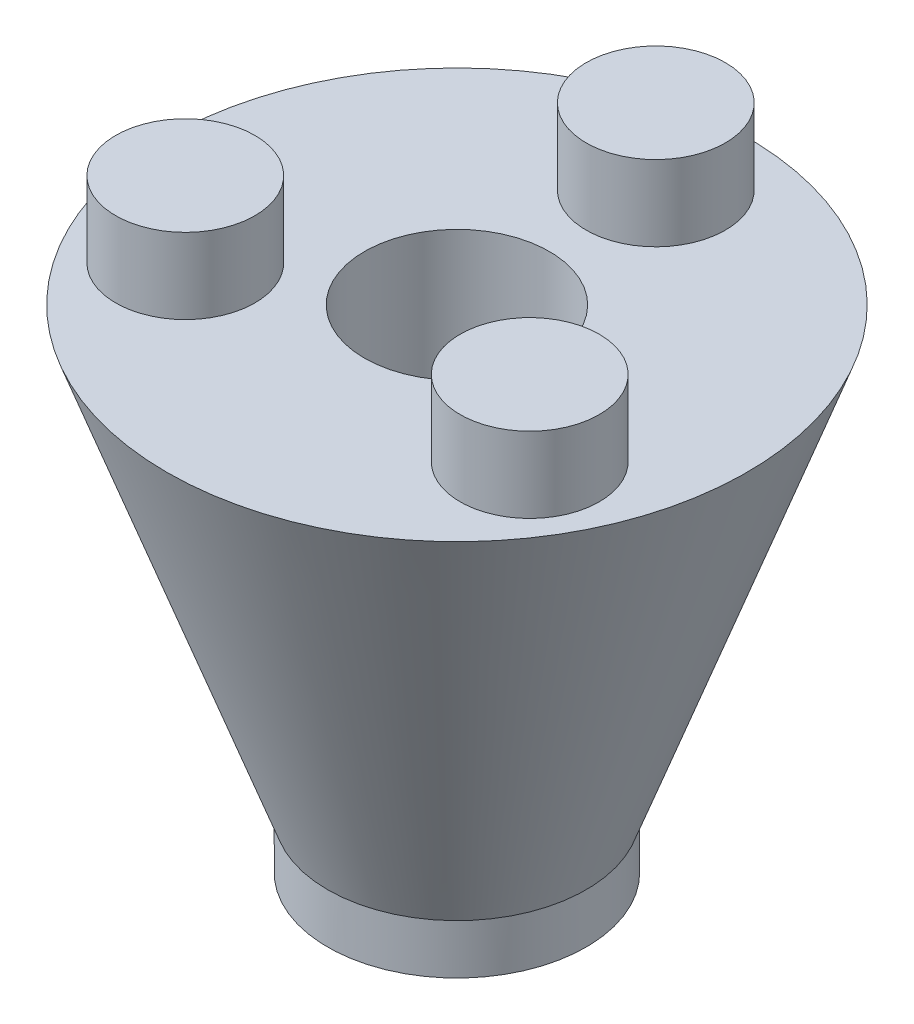
ISO-10303-21;
HEADER;
FILE_DESCRIPTION(('STEP AP214'),'2;1');
FILE_NAME('part.step','',(''),(''),'','','');
FILE_SCHEMA(('AUTOMOTIVE_DESIGN { 1 0 10303 214 1 1 1 1 }'));
ENDSEC;
DATA;
#1=APPLICATION_CONTEXT('core data for automotive mechanical design processes');
#2=APPLICATION_PROTOCOL_DEFINITION('international standard','automotive_design',2000,#1);
#3=PRODUCT_CONTEXT('',#1,'mechanical');
#4=PRODUCT('Part','Part','',(#3));
#5=PRODUCT_RELATED_PRODUCT_CATEGORY('part','',(#4));
#6=PRODUCT_DEFINITION_FORMATION('','',#4);
#7=PRODUCT_DEFINITION_CONTEXT('part definition',#1,'design');
#8=PRODUCT_DEFINITION('design','',#6,#7);
#9=PRODUCT_DEFINITION_SHAPE('','',#8);
#10=(LENGTH_UNIT() NAMED_UNIT(*) SI_UNIT(.MILLI.,.METRE.));
#11=(NAMED_UNIT(*) PLANE_ANGLE_UNIT() SI_UNIT($,.RADIAN.));
#12=(NAMED_UNIT(*) SI_UNIT($,.STERADIAN.) SOLID_ANGLE_UNIT());
#13=UNCERTAINTY_MEASURE_WITH_UNIT(LENGTH_MEASURE(1.E-05),#10,'distance_accuracy_value','');
#14=(GEOMETRIC_REPRESENTATION_CONTEXT(3) GLOBAL_UNCERTAINTY_ASSIGNED_CONTEXT((#13)) GLOBAL_UNIT_ASSIGNED_CONTEXT((#10,
#11,#12)) REPRESENTATION_CONTEXT('',''));
#15=CARTESIAN_POINT('',(0.,0.,0.));
#16=DIRECTION('',(0.,0.,1.));
#17=DIRECTION('',(1.,0.,0.));
#18=AXIS2_PLACEMENT_3D('',#15,#16,#17);
#19=CARTESIAN_POINT('',(0.,22.225,0.));
#20=DIRECTION('',(0.,1.,0.));
#21=DIRECTION('',(0.,0.,1.));
#22=AXIS2_PLACEMENT_3D('',#19,#20,#21);
#23=PLANE('',#22);
#24=CARTESIAN_POINT('',(-8.66025409500206,22.225,5.000000033));
#25=DIRECTION('',(0.,1.,0.));
#26=DIRECTION('',(0.,0.,1.));
#27=AXIS2_PLACEMENT_3D('',#24,#25,#26);
#28=CIRCLE('',#27,3.499999985);
#29=CARTESIAN_POINT('',(-8.66025409500206,22.225,1.500000048));
#30=VERTEX_POINT('',#29);
#31=EDGE_CURVE('E56',#30,#30,#28,.T.);
#32=ORIENTED_EDGE('',*,*,#31,.F.);
#33=EDGE_LOOP('',(#32));
#34=FACE_BOUND('',#33,.T.);
#35=CARTESIAN_POINT('',(0.,22.225,0.));
#36=DIRECTION('',(0.,1.,0.));
#37=DIRECTION('',(0.,0.,1.));
#38=AXIS2_PLACEMENT_3D('',#35,#36,#37);
#39=CIRCLE('',#38,14.5892385375664);
#40=CARTESIAN_POINT('',(0.,22.225,14.5892385375664));
#41=VERTEX_POINT('',#40);
#42=EDGE_CURVE('E10',#41,#41,#39,.T.);
#43=ORIENTED_EDGE('',*,*,#42,.T.);
#44=EDGE_LOOP('',(#43));
#45=FACE_BOUND('',#44,.T.);
#46=CARTESIAN_POINT('',(0.,22.225,0.));
#47=DIRECTION('',(0.,1.,0.));
#48=DIRECTION('',(0.,0.,1.));
#49=AXIS2_PLACEMENT_3D('',#46,#47,#48);
#50=CIRCLE('',#49,4.649999971);
#51=CARTESIAN_POINT('',(0.,22.225,4.649999971));
#52=VERTEX_POINT('',#51);
#53=EDGE_CURVE('E43',#52,#52,#50,.T.);
#54=ORIENTED_EDGE('',*,*,#53,.F.);
#55=EDGE_LOOP('',(#54));
#56=FACE_BOUND('',#55,.T.);
#57=CARTESIAN_POINT('',(0.,22.225,-10.000000066));
#58=DIRECTION('',(0.,1.,0.));
#59=DIRECTION('',(0.,0.,1.));
#60=AXIS2_PLACEMENT_3D('',#57,#58,#59);
#61=CIRCLE('',#60,3.499999985);
#62=CARTESIAN_POINT('',(0.,22.225,-13.500000051));
#63=VERTEX_POINT('',#62);
#64=EDGE_CURVE('E50',#63,#63,#61,.T.);
#65=ORIENTED_EDGE('',*,*,#64,.F.);
#66=EDGE_LOOP('',(#65));
#67=FACE_BOUND('',#66,.T.);
#68=CARTESIAN_POINT('',(8.66025409500207,22.225,5.000000033));
#69=DIRECTION('',(0.,1.,0.));
#70=DIRECTION('',(0.,0.,1.));
#71=AXIS2_PLACEMENT_3D('',#68,#69,#70);
#72=CIRCLE('',#71,3.499999985);
#73=CARTESIAN_POINT('',(8.66025409500207,22.225,1.500000048));
#74=VERTEX_POINT('',#73);
#75=EDGE_CURVE('E62',#74,#74,#72,.T.);
#76=ORIENTED_EDGE('',*,*,#75,.F.);
#77=EDGE_LOOP('',(#76));
#78=FACE_BOUND('',#77,.T.);
#79=ADVANCED_FACE('F32',(#34,#45,#56,#67,#78),#23,.T.);
#80=CARTESIAN_POINT('',(0.,0.,0.));
#81=DIRECTION('',(0.,1.,0.));
#82=DIRECTION('',(0.,0.,1.));
#83=AXIS2_PLACEMENT_3D('',#80,#81,#82);
#84=CONICAL_SURFACE('',#83,6.500000081,0.349065850398867);
#85=ORIENTED_EDGE('',*,*,#42,.F.);
#86=EDGE_LOOP('',(#85));
#87=FACE_BOUND('',#86,.T.);
#88=CARTESIAN_POINT('',(0.,0.,0.));
#89=DIRECTION('',(0.,-1.,0.));
#90=DIRECTION('',(0.,0.,-1.));
#91=AXIS2_PLACEMENT_3D('',#88,#89,#90);
#92=CIRCLE('',#91,6.500000081);
#93=CARTESIAN_POINT('',(0.,0.,-6.500000081));
#94=VERTEX_POINT('',#93);
#95=EDGE_CURVE('E68',#94,#94,#92,.T.);
#96=ORIENTED_EDGE('',*,*,#95,.F.);
#97=EDGE_LOOP('',(#96));
#98=FACE_BOUND('',#97,.T.);
#99=ADVANCED_FACE('F34',(#87,#98),#84,.T.);
#100=CARTESIAN_POINT('',(0.,0.,0.));
#101=DIRECTION('',(0.,1.,0.));
#102=DIRECTION('',(0.,0.,1.));
#103=AXIS2_PLACEMENT_3D('',#100,#101,#102);
#104=CYLINDRICAL_SURFACE('',#103,4.649999971);
#105=CARTESIAN_POINT('',(0.,0.,0.));
#106=DIRECTION('',(0.,1.,0.));
#107=DIRECTION('',(0.,0.,1.));
#108=AXIS2_PLACEMENT_3D('',#105,#106,#107);
#109=CIRCLE('',#108,4.649999971);
#110=CARTESIAN_POINT('',(0.,0.,4.649999971));
#111=VERTEX_POINT('',#110);
#112=EDGE_CURVE('E39',#111,#111,#109,.T.);
#113=ORIENTED_EDGE('',*,*,#112,.F.);
#114=EDGE_LOOP('',(#113));
#115=FACE_BOUND('',#114,.T.);
#116=ORIENTED_EDGE('',*,*,#53,.T.);
#117=EDGE_LOOP('',(#116));
#118=FACE_BOUND('',#117,.T.);
#119=ADVANCED_FACE('F104',(#115,#118),#104,.F.);
#120=CARTESIAN_POINT('',(0.,26.02500002,-10.000000066));
#121=DIRECTION('',(0.,-1.,0.));
#122=DIRECTION('',(0.,0.,-1.));
#123=AXIS2_PLACEMENT_3D('',#120,#121,#122);
#124=CYLINDRICAL_SURFACE('',#123,3.499999985);
#125=CARTESIAN_POINT('',(0.,26.02500002,-10.000000066));
#126=DIRECTION('',(0.,1.,0.));
#127=DIRECTION('',(0.,0.,1.));
#128=AXIS2_PLACEMENT_3D('',#125,#126,#127);
#129=CIRCLE('',#128,3.499999985);
#130=CARTESIAN_POINT('',(0.,26.02500002,-13.500000051));
#131=VERTEX_POINT('',#130);
#132=EDGE_CURVE('E48',#131,#131,#129,.T.);
#133=CARTESIAN_POINT('',(0.,26.02500002,-13.500000051));
#134=CARTESIAN_POINT('',(0.,25.9854166864583,-13.500000051));
#135=CARTESIAN_POINT('',(0.,25.9458333529167,-13.500000051));
#136=CARTESIAN_POINT('',(0.,25.8666666858333,-13.500000051));
#137=CARTESIAN_POINT('',(0.,25.8270833522917,-13.500000051));
#138=CARTESIAN_POINT('',(0.,25.7479166852083,-13.500000051));
#139=CARTESIAN_POINT('',(0.,25.7083333516667,-13.500000051));
#140=CARTESIAN_POINT('',(0.,25.6291666845833,-13.500000051));
#141=CARTESIAN_POINT('',(0.,25.5895833510417,-13.500000051));
#142=CARTESIAN_POINT('',(0.,25.5104166839583,-13.500000051));
#143=CARTESIAN_POINT('',(0.,25.4708333504167,-13.500000051));
#144=CARTESIAN_POINT('',(0.,25.3916666833333,-13.500000051));
#145=CARTESIAN_POINT('',(0.,25.3520833497917,-13.500000051));
#146=CARTESIAN_POINT('',(0.,25.2729166827083,-13.500000051));
#147=CARTESIAN_POINT('',(0.,25.2333333491667,-13.500000051));
#148=CARTESIAN_POINT('',(0.,25.1541666820833,-13.500000051));
#149=CARTESIAN_POINT('',(0.,25.1145833485417,-13.500000051));
#150=CARTESIAN_POINT('',(0.,25.0354166814583,-13.500000051));
#151=CARTESIAN_POINT('',(0.,24.9958333479167,-13.500000051));
#152=CARTESIAN_POINT('',(0.,24.9166666808333,-13.500000051));
#153=CARTESIAN_POINT('',(0.,24.8770833472917,-13.500000051));
#154=CARTESIAN_POINT('',(0.,24.7979166802083,-13.500000051));
#155=CARTESIAN_POINT('',(0.,24.7583333466667,-13.500000051));
#156=CARTESIAN_POINT('',(0.,24.6791666795833,-13.500000051));
#157=CARTESIAN_POINT('',(0.,24.6395833460417,-13.500000051));
#158=CARTESIAN_POINT('',(0.,24.5604166789583,-13.500000051));
#159=CARTESIAN_POINT('',(0.,24.5208333454167,-13.500000051));
#160=CARTESIAN_POINT('',(0.,24.4416666783333,-13.500000051));
#161=CARTESIAN_POINT('',(0.,24.4020833447917,-13.500000051));
#162=CARTESIAN_POINT('',(0.,24.3229166777083,-13.500000051));
#163=CARTESIAN_POINT('',(0.,24.2833333441667,-13.500000051));
#164=CARTESIAN_POINT('',(0.,24.2041666770833,-13.500000051));
#165=CARTESIAN_POINT('',(0.,24.1645833435417,-13.500000051));
#166=CARTESIAN_POINT('',(0.,24.0854166764583,-13.500000051));
#167=CARTESIAN_POINT('',(0.,24.0458333429167,-13.500000051));
#168=CARTESIAN_POINT('',(0.,23.9666666758333,-13.500000051));
#169=CARTESIAN_POINT('',(0.,23.9270833422917,-13.500000051));
#170=CARTESIAN_POINT('',(0.,23.8479166752083,-13.500000051));
#171=CARTESIAN_POINT('',(0.,23.8083333416667,-13.500000051));
#172=CARTESIAN_POINT('',(0.,23.7291666745833,-13.500000051));
#173=CARTESIAN_POINT('',(0.,23.6895833410417,-13.500000051));
#174=CARTESIAN_POINT('',(0.,23.6104166739583,-13.500000051));
#175=CARTESIAN_POINT('',(0.,23.5708333404167,-13.500000051));
#176=CARTESIAN_POINT('',(0.,23.4916666733333,-13.500000051));
#177=CARTESIAN_POINT('',(0.,23.4520833397917,-13.500000051));
#178=CARTESIAN_POINT('',(0.,23.3729166727083,-13.500000051));
#179=CARTESIAN_POINT('',(0.,23.3333333391667,-13.500000051));
#180=CARTESIAN_POINT('',(0.,23.2541666720833,-13.500000051));
#181=CARTESIAN_POINT('',(0.,23.2145833385417,-13.500000051));
#182=CARTESIAN_POINT('',(0.,23.1354166714583,-13.500000051));
#183=CARTESIAN_POINT('',(0.,23.0958333379167,-13.500000051));
#184=CARTESIAN_POINT('',(0.,23.0166666708333,-13.500000051));
#185=CARTESIAN_POINT('',(0.,22.9770833372917,-13.500000051));
#186=CARTESIAN_POINT('',(0.,22.8979166702083,-13.500000051));
#187=CARTESIAN_POINT('',(0.,22.8583333366667,-13.500000051));
#188=CARTESIAN_POINT('',(0.,22.7791666695833,-13.500000051));
#189=CARTESIAN_POINT('',(0.,22.7395833360417,-13.500000051));
#190=CARTESIAN_POINT('',(0.,22.6604166689583,-13.500000051));
#191=CARTESIAN_POINT('',(0.,22.6208333354167,-13.500000051));
#192=CARTESIAN_POINT('',(0.,22.5416666683333,-13.500000051));
#193=CARTESIAN_POINT('',(0.,22.5020833347917,-13.500000051));
#194=CARTESIAN_POINT('',(0.,22.4229166677083,-13.500000051));
#195=CARTESIAN_POINT('',(0.,22.3833333341667,-13.500000051));
#196=CARTESIAN_POINT('',(0.,22.3041666670833,-13.500000051));
#197=CARTESIAN_POINT('',(0.,22.2645833335417,-13.500000051));
#198=CARTESIAN_POINT('',(0.,22.225,-13.500000051));
#199=B_SPLINE_CURVE_WITH_KNOTS('',3,(#133,#134,#135,#136,#137,#138,#139,#140,#141,#142,#143,
#144,#145,#146,#147,#148,#149,#150,#151,#152,#153,#154,#155,#156,#157,#158,#159,#160,#161,#162,
#163,#164,#165,#166,#167,#168,#169,#170,#171,#172,#173,#174,#175,#176,#177,#178,#179,#180,#181,
#182,#183,#184,#185,#186,#187,#188,#189,#190,#191,#192,#193,#194,#195,#196,#197,#198),
.UNSPECIFIED.,.F.,.F.,(4,2,2,2,2,2,2,2,2,2,2,2,2,2,2,2,2,2,2,2,2,2,2,2,2,2,2,2,2,2,2,2,4),(0.,
0.118750000624997,0.237500001249998,0.356250001874999,0.475000002499996,0.593750003124997,
0.712500003749998,0.831250004374999,0.950000004999996,1.068750005625,1.18750000625,
1.306250006875,1.4250000075,1.543750008125,1.66250000875,1.781250009375,1.90000001,
2.018750010625,2.13750001125,2.256250011875,2.3750000125,2.493750013125,2.61250001375,
2.731250014375,2.850000015,2.968750015625,3.08750001625,3.206250016875,3.3250000175,
3.443750018125,3.56250001875,3.681250019375,3.80000002),.UNSPECIFIED.);
#200=EDGE_CURVE('BSEAM110',#131,#63,#199,.T.);
#201=ORIENTED_EDGE('',*,*,#132,.F.);
#202=ORIENTED_EDGE('',*,*,#64,.T.);
#203=ORIENTED_EDGE('',*,*,#200,.T.);
#204=ORIENTED_EDGE('',*,*,#200,.F.);
#205=EDGE_LOOP('',(#201,#203,#202,#204));
#206=FACE_BOUND('',#205,.T.);
#207=ADVANCED_FACE('F110',(#206),#124,.T.);
#208=CARTESIAN_POINT('',(0.,26.02500002,0.));
#209=DIRECTION('',(0.,1.,0.));
#210=DIRECTION('',(0.,0.,1.));
#211=AXIS2_PLACEMENT_3D('',#208,#209,#210);
#212=PLANE('',#211);
#213=ORIENTED_EDGE('',*,*,#132,.T.);
#214=EDGE_LOOP('',(#213));
#215=FACE_BOUND('',#214,.T.);
#216=ADVANCED_FACE('F114',(#215),#212,.T.);
#217=CARTESIAN_POINT('',(-8.66025409500206,26.02500002,5.000000033));
#218=DIRECTION('',(0.,-1.,0.));
#219=DIRECTION('',(0.,0.,-1.));
#220=AXIS2_PLACEMENT_3D('',#217,#218,#219);
#221=CYLINDRICAL_SURFACE('',#220,3.499999985);
#222=CARTESIAN_POINT('',(-8.66025409500206,26.02500002,5.000000033));
#223=DIRECTION('',(0.,1.,0.));
#224=DIRECTION('',(0.,0.,1.));
#225=AXIS2_PLACEMENT_3D('',#222,#223,#224);
#226=CIRCLE('',#225,3.499999985);
#227=CARTESIAN_POINT('',(-8.66025409500206,26.02500002,1.500000048));
#228=VERTEX_POINT('',#227);
#229=EDGE_CURVE('E53',#228,#228,#226,.T.);
#230=CARTESIAN_POINT('',(-8.66025409500206,26.02500002,1.500000048));
#231=CARTESIAN_POINT('',(-8.66025409500206,25.9854166864583,1.500000048));
#232=CARTESIAN_POINT('',(-8.66025409500206,25.9458333529167,1.500000048));
#233=CARTESIAN_POINT('',(-8.66025409500206,25.8666666858333,1.500000048));
#234=CARTESIAN_POINT('',(-8.66025409500206,25.8270833522917,1.500000048));
#235=CARTESIAN_POINT('',(-8.66025409500206,25.7479166852083,1.500000048));
#236=CARTESIAN_POINT('',(-8.66025409500206,25.7083333516667,1.500000048));
#237=CARTESIAN_POINT('',(-8.66025409500206,25.6291666845833,1.500000048));
#238=CARTESIAN_POINT('',(-8.66025409500206,25.5895833510417,1.500000048));
#239=CARTESIAN_POINT('',(-8.66025409500206,25.5104166839583,1.500000048));
#240=CARTESIAN_POINT('',(-8.66025409500206,25.4708333504167,1.500000048));
#241=CARTESIAN_POINT('',(-8.66025409500206,25.3916666833333,1.500000048));
#242=CARTESIAN_POINT('',(-8.66025409500206,25.3520833497917,1.500000048));
#243=CARTESIAN_POINT('',(-8.66025409500206,25.2729166827083,1.500000048));
#244=CARTESIAN_POINT('',(-8.66025409500206,25.2333333491667,1.500000048));
#245=CARTESIAN_POINT('',(-8.66025409500206,25.1541666820833,1.500000048));
#246=CARTESIAN_POINT('',(-8.66025409500206,25.1145833485417,1.500000048));
#247=CARTESIAN_POINT('',(-8.66025409500206,25.0354166814583,1.500000048));
#248=CARTESIAN_POINT('',(-8.66025409500206,24.9958333479167,1.500000048));
#249=CARTESIAN_POINT('',(-8.66025409500206,24.9166666808333,1.500000048));
#250=CARTESIAN_POINT('',(-8.66025409500206,24.8770833472917,1.500000048));
#251=CARTESIAN_POINT('',(-8.66025409500206,24.7979166802083,1.500000048));
#252=CARTESIAN_POINT('',(-8.66025409500206,24.7583333466667,1.500000048));
#253=CARTESIAN_POINT('',(-8.66025409500206,24.6791666795833,1.500000048));
#254=CARTESIAN_POINT('',(-8.66025409500206,24.6395833460417,1.500000048));
#255=CARTESIAN_POINT('',(-8.66025409500206,24.5604166789583,1.500000048));
#256=CARTESIAN_POINT('',(-8.66025409500206,24.5208333454167,1.500000048));
#257=CARTESIAN_POINT('',(-8.66025409500206,24.4416666783333,1.500000048));
#258=CARTESIAN_POINT('',(-8.66025409500206,24.4020833447917,1.500000048));
#259=CARTESIAN_POINT('',(-8.66025409500206,24.3229166777083,1.500000048));
#260=CARTESIAN_POINT('',(-8.66025409500206,24.2833333441667,1.500000048));
#261=CARTESIAN_POINT('',(-8.66025409500206,24.2041666770833,1.500000048));
#262=CARTESIAN_POINT('',(-8.66025409500206,24.1645833435417,1.500000048));
#263=CARTESIAN_POINT('',(-8.66025409500206,24.0854166764583,1.500000048));
#264=CARTESIAN_POINT('',(-8.66025409500206,24.0458333429167,1.500000048));
#265=CARTESIAN_POINT('',(-8.66025409500206,23.9666666758333,1.500000048));
#266=CARTESIAN_POINT('',(-8.66025409500206,23.9270833422917,1.500000048));
#267=CARTESIAN_POINT('',(-8.66025409500206,23.8479166752083,1.500000048));
#268=CARTESIAN_POINT('',(-8.66025409500206,23.8083333416667,1.500000048));
#269=CARTESIAN_POINT('',(-8.66025409500206,23.7291666745833,1.500000048));
#270=CARTESIAN_POINT('',(-8.66025409500206,23.6895833410417,1.500000048));
#271=CARTESIAN_POINT('',(-8.66025409500206,23.6104166739583,1.500000048));
#272=CARTESIAN_POINT('',(-8.66025409500206,23.5708333404167,1.500000048));
#273=CARTESIAN_POINT('',(-8.66025409500206,23.4916666733333,1.500000048));
#274=CARTESIAN_POINT('',(-8.66025409500206,23.4520833397917,1.500000048));
#275=CARTESIAN_POINT('',(-8.66025409500206,23.3729166727083,1.500000048));
#276=CARTESIAN_POINT('',(-8.66025409500206,23.3333333391667,1.500000048));
#277=CARTESIAN_POINT('',(-8.66025409500206,23.2541666720833,1.500000048));
#278=CARTESIAN_POINT('',(-8.66025409500206,23.2145833385417,1.500000048));
#279=CARTESIAN_POINT('',(-8.66025409500206,23.1354166714583,1.500000048));
#280=CARTESIAN_POINT('',(-8.66025409500206,23.0958333379167,1.500000048));
#281=CARTESIAN_POINT('',(-8.66025409500206,23.0166666708333,1.500000048));
#282=CARTESIAN_POINT('',(-8.66025409500206,22.9770833372917,1.500000048));
#283=CARTESIAN_POINT('',(-8.66025409500206,22.8979166702083,1.500000048));
#284=CARTESIAN_POINT('',(-8.66025409500206,22.8583333366667,1.500000048));
#285=CARTESIAN_POINT('',(-8.66025409500206,22.7791666695833,1.500000048));
#286=CARTESIAN_POINT('',(-8.66025409500206,22.7395833360417,1.500000048));
#287=CARTESIAN_POINT('',(-8.66025409500206,22.6604166689583,1.500000048));
#288=CARTESIAN_POINT('',(-8.66025409500206,22.6208333354167,1.500000048));
#289=CARTESIAN_POINT('',(-8.66025409500206,22.5416666683333,1.500000048));
#290=CARTESIAN_POINT('',(-8.66025409500206,22.5020833347917,1.500000048));
#291=CARTESIAN_POINT('',(-8.66025409500206,22.4229166677083,1.500000048));
#292=CARTESIAN_POINT('',(-8.66025409500206,22.3833333341667,1.500000048));
#293=CARTESIAN_POINT('',(-8.66025409500206,22.3041666670833,1.500000048));
#294=CARTESIAN_POINT('',(-8.66025409500206,22.2645833335417,1.500000048));
#295=CARTESIAN_POINT('',(-8.66025409500206,22.225,1.500000048));
#296=B_SPLINE_CURVE_WITH_KNOTS('',3,(#230,#231,#232,#233,#234,#235,#236,#237,#238,#239,#240,
#241,#242,#243,#244,#245,#246,#247,#248,#249,#250,#251,#252,#253,#254,#255,#256,#257,#258,#259,
#260,#261,#262,#263,#264,#265,#266,#267,#268,#269,#270,#271,#272,#273,#274,#275,#276,#277,#278,
#279,#280,#281,#282,#283,#284,#285,#286,#287,#288,#289,#290,#291,#292,#293,#294,#295),
.UNSPECIFIED.,.F.,.F.,(4,2,2,2,2,2,2,2,2,2,2,2,2,2,2,2,2,2,2,2,2,2,2,2,2,2,2,2,2,2,2,2,4),(0.,
0.118750000624997,0.237500001249998,0.356250001874999,0.475000002499996,0.593750003124997,
0.712500003749998,0.831250004374999,0.950000004999996,1.068750005625,1.18750000625,
1.306250006875,1.4250000075,1.543750008125,1.66250000875,1.781250009375,1.90000001,
2.018750010625,2.13750001125,2.256250011875,2.3750000125,2.493750013125,2.61250001375,
2.731250014375,2.850000015,2.968750015625,3.08750001625,3.206250016875,3.3250000175,
3.443750018125,3.56250001875,3.681250019375,3.80000002),.UNSPECIFIED.);
#297=EDGE_CURVE('BSEAM118',#228,#30,#296,.T.);
#298=ORIENTED_EDGE('',*,*,#229,.F.);
#299=ORIENTED_EDGE('',*,*,#31,.T.);
#300=ORIENTED_EDGE('',*,*,#297,.T.);
#301=ORIENTED_EDGE('',*,*,#297,.F.);
#302=EDGE_LOOP('',(#298,#300,#299,#301));
#303=FACE_BOUND('',#302,.T.);
#304=ADVANCED_FACE('F118',(#303),#221,.T.);
#305=CARTESIAN_POINT('',(0.,26.02500002,0.));
#306=DIRECTION('',(0.,1.,0.));
#307=DIRECTION('',(0.,0.,1.));
#308=AXIS2_PLACEMENT_3D('',#305,#306,#307);
#309=PLANE('',#308);
#310=ORIENTED_EDGE('',*,*,#229,.T.);
#311=EDGE_LOOP('',(#310));
#312=FACE_BOUND('',#311,.T.);
#313=ADVANCED_FACE('F122',(#312),#309,.T.);
#314=CARTESIAN_POINT('',(8.66025409500207,26.02500002,5.000000033));
#315=DIRECTION('',(0.,-1.,0.));
#316=DIRECTION('',(0.,0.,-1.));
#317=AXIS2_PLACEMENT_3D('',#314,#315,#316);
#318=CYLINDRICAL_SURFACE('',#317,3.499999985);
#319=CARTESIAN_POINT('',(8.66025409500207,26.02500002,5.000000033));
#320=DIRECTION('',(0.,1.,0.));
#321=DIRECTION('',(0.,0.,1.));
#322=AXIS2_PLACEMENT_3D('',#319,#320,#321);
#323=CIRCLE('',#322,3.499999985);
#324=CARTESIAN_POINT('',(8.66025409500207,26.02500002,1.500000048));
#325=VERTEX_POINT('',#324);
#326=EDGE_CURVE('E59',#325,#325,#323,.T.);
#327=CARTESIAN_POINT('',(8.66025409500207,26.02500002,1.500000048));
#328=CARTESIAN_POINT('',(8.66025409500207,25.9854166864583,1.500000048));
#329=CARTESIAN_POINT('',(8.66025409500207,25.9458333529167,1.500000048));
#330=CARTESIAN_POINT('',(8.66025409500207,25.8666666858333,1.500000048));
#331=CARTESIAN_POINT('',(8.66025409500207,25.8270833522917,1.500000048));
#332=CARTESIAN_POINT('',(8.66025409500207,25.7479166852083,1.500000048));
#333=CARTESIAN_POINT('',(8.66025409500207,25.7083333516667,1.500000048));
#334=CARTESIAN_POINT('',(8.66025409500207,25.6291666845833,1.500000048));
#335=CARTESIAN_POINT('',(8.66025409500207,25.5895833510417,1.500000048));
#336=CARTESIAN_POINT('',(8.66025409500207,25.5104166839583,1.500000048));
#337=CARTESIAN_POINT('',(8.66025409500207,25.4708333504167,1.500000048));
#338=CARTESIAN_POINT('',(8.66025409500207,25.3916666833333,1.500000048));
#339=CARTESIAN_POINT('',(8.66025409500207,25.3520833497917,1.500000048));
#340=CARTESIAN_POINT('',(8.66025409500207,25.2729166827083,1.500000048));
#341=CARTESIAN_POINT('',(8.66025409500207,25.2333333491667,1.500000048));
#342=CARTESIAN_POINT('',(8.66025409500207,25.1541666820833,1.500000048));
#343=CARTESIAN_POINT('',(8.66025409500207,25.1145833485417,1.500000048));
#344=CARTESIAN_POINT('',(8.66025409500207,25.0354166814583,1.500000048));
#345=CARTESIAN_POINT('',(8.66025409500207,24.9958333479167,1.500000048));
#346=CARTESIAN_POINT('',(8.66025409500207,24.9166666808333,1.500000048));
#347=CARTESIAN_POINT('',(8.66025409500207,24.8770833472917,1.500000048));
#348=CARTESIAN_POINT('',(8.66025409500207,24.7979166802083,1.500000048));
#349=CARTESIAN_POINT('',(8.66025409500207,24.7583333466667,1.500000048));
#350=CARTESIAN_POINT('',(8.66025409500207,24.6791666795833,1.500000048));
#351=CARTESIAN_POINT('',(8.66025409500207,24.6395833460417,1.500000048));
#352=CARTESIAN_POINT('',(8.66025409500207,24.5604166789583,1.500000048));
#353=CARTESIAN_POINT('',(8.66025409500207,24.5208333454167,1.500000048));
#354=CARTESIAN_POINT('',(8.66025409500207,24.4416666783333,1.500000048));
#355=CARTESIAN_POINT('',(8.66025409500207,24.4020833447917,1.500000048));
#356=CARTESIAN_POINT('',(8.66025409500207,24.3229166777083,1.500000048));
#357=CARTESIAN_POINT('',(8.66025409500207,24.2833333441667,1.500000048));
#358=CARTESIAN_POINT('',(8.66025409500207,24.2041666770833,1.500000048));
#359=CARTESIAN_POINT('',(8.66025409500207,24.1645833435417,1.500000048));
#360=CARTESIAN_POINT('',(8.66025409500207,24.0854166764583,1.500000048));
#361=CARTESIAN_POINT('',(8.66025409500207,24.0458333429167,1.500000048));
#362=CARTESIAN_POINT('',(8.66025409500207,23.9666666758333,1.500000048));
#363=CARTESIAN_POINT('',(8.66025409500207,23.9270833422917,1.500000048));
#364=CARTESIAN_POINT('',(8.66025409500207,23.8479166752083,1.500000048));
#365=CARTESIAN_POINT('',(8.66025409500207,23.8083333416667,1.500000048));
#366=CARTESIAN_POINT('',(8.66025409500207,23.7291666745833,1.500000048));
#367=CARTESIAN_POINT('',(8.66025409500207,23.6895833410417,1.500000048));
#368=CARTESIAN_POINT('',(8.66025409500207,23.6104166739583,1.500000048));
#369=CARTESIAN_POINT('',(8.66025409500207,23.5708333404167,1.500000048));
#370=CARTESIAN_POINT('',(8.66025409500207,23.4916666733333,1.500000048));
#371=CARTESIAN_POINT('',(8.66025409500207,23.4520833397917,1.500000048));
#372=CARTESIAN_POINT('',(8.66025409500207,23.3729166727083,1.500000048));
#373=CARTESIAN_POINT('',(8.66025409500207,23.3333333391667,1.500000048));
#374=CARTESIAN_POINT('',(8.66025409500207,23.2541666720833,1.500000048));
#375=CARTESIAN_POINT('',(8.66025409500207,23.2145833385417,1.500000048));
#376=CARTESIAN_POINT('',(8.66025409500207,23.1354166714583,1.500000048));
#377=CARTESIAN_POINT('',(8.66025409500207,23.0958333379167,1.500000048));
#378=CARTESIAN_POINT('',(8.66025409500207,23.0166666708333,1.500000048));
#379=CARTESIAN_POINT('',(8.66025409500207,22.9770833372917,1.500000048));
#380=CARTESIAN_POINT('',(8.66025409500207,22.8979166702083,1.500000048));
#381=CARTESIAN_POINT('',(8.66025409500207,22.8583333366667,1.500000048));
#382=CARTESIAN_POINT('',(8.66025409500207,22.7791666695833,1.500000048));
#383=CARTESIAN_POINT('',(8.66025409500207,22.7395833360417,1.500000048));
#384=CARTESIAN_POINT('',(8.66025409500207,22.6604166689583,1.500000048));
#385=CARTESIAN_POINT('',(8.66025409500207,22.6208333354167,1.500000048));
#386=CARTESIAN_POINT('',(8.66025409500207,22.5416666683333,1.500000048));
#387=CARTESIAN_POINT('',(8.66025409500207,22.5020833347917,1.500000048));
#388=CARTESIAN_POINT('',(8.66025409500207,22.4229166677083,1.500000048));
#389=CARTESIAN_POINT('',(8.66025409500207,22.3833333341667,1.500000048));
#390=CARTESIAN_POINT('',(8.66025409500207,22.3041666670833,1.500000048));
#391=CARTESIAN_POINT('',(8.66025409500207,22.2645833335417,1.500000048));
#392=CARTESIAN_POINT('',(8.66025409500207,22.225,1.500000048));
#393=B_SPLINE_CURVE_WITH_KNOTS('',3,(#327,#328,#329,#330,#331,#332,#333,#334,#335,#336,#337,
#338,#339,#340,#341,#342,#343,#344,#345,#346,#347,#348,#349,#350,#351,#352,#353,#354,#355,#356,
#357,#358,#359,#360,#361,#362,#363,#364,#365,#366,#367,#368,#369,#370,#371,#372,#373,#374,#375,
#376,#377,#378,#379,#380,#381,#382,#383,#384,#385,#386,#387,#388,#389,#390,#391,#392),
.UNSPECIFIED.,.F.,.F.,(4,2,2,2,2,2,2,2,2,2,2,2,2,2,2,2,2,2,2,2,2,2,2,2,2,2,2,2,2,2,2,2,4),(0.,
0.118750000624997,0.237500001249998,0.356250001874999,0.475000002499996,0.593750003124997,
0.712500003749998,0.831250004374999,0.950000004999996,1.068750005625,1.18750000625,
1.306250006875,1.4250000075,1.543750008125,1.66250000875,1.781250009375,1.90000001,
2.018750010625,2.13750001125,2.256250011875,2.3750000125,2.493750013125,2.61250001375,
2.731250014375,2.850000015,2.968750015625,3.08750001625,3.206250016875,3.3250000175,
3.443750018125,3.56250001875,3.681250019375,3.80000002),.UNSPECIFIED.);
#394=EDGE_CURVE('BSEAM126',#325,#74,#393,.T.);
#395=ORIENTED_EDGE('',*,*,#326,.F.);
#396=ORIENTED_EDGE('',*,*,#75,.T.);
#397=ORIENTED_EDGE('',*,*,#394,.T.);
#398=ORIENTED_EDGE('',*,*,#394,.F.);
#399=EDGE_LOOP('',(#395,#397,#396,#398));
#400=FACE_BOUND('',#399,.T.);
#401=ADVANCED_FACE('F126',(#400),#318,.T.);
#402=CARTESIAN_POINT('',(0.,26.02500002,0.));
#403=DIRECTION('',(0.,1.,0.));
#404=DIRECTION('',(0.,0.,1.));
#405=AXIS2_PLACEMENT_3D('',#402,#403,#404);
#406=PLANE('',#405);
#407=ORIENTED_EDGE('',*,*,#326,.T.);
#408=EDGE_LOOP('',(#407));
#409=FACE_BOUND('',#408,.T.);
#410=ADVANCED_FACE('F95',(#409),#406,.T.);
#411=CARTESIAN_POINT('',(0.,0.,0.));
#412=DIRECTION('',(0.,-1.,0.));
#413=DIRECTION('',(0.,0.,-1.));
#414=AXIS2_PLACEMENT_3D('',#411,#412,#413);
#415=PLANE('',#414);
#416=CARTESIAN_POINT('',(0.,0.,0.));
#417=DIRECTION('',(0.,-1.,0.));
#418=DIRECTION('',(0.,0.,-1.));
#419=AXIS2_PLACEMENT_3D('',#416,#417,#418);
#420=CIRCLE('',#419,3.300000004);
#421=CARTESIAN_POINT('',(0.,0.,-3.300000004));
#422=VERTEX_POINT('',#421);
#423=EDGE_CURVE('E74',#422,#422,#420,.T.);
#424=ORIENTED_EDGE('',*,*,#423,.T.);
#425=EDGE_LOOP('',(#424));
#426=FACE_BOUND('',#425,.T.);
#427=ORIENTED_EDGE('',*,*,#112,.T.);
#428=EDGE_LOOP('',(#427));
#429=FACE_BOUND('',#428,.T.);
#430=ADVANCED_FACE('F86',(#426,#429),#415,.F.);
#431=CARTESIAN_POINT('',(0.,-2.50000008,0.));
#432=DIRECTION('',(0.,-1.,0.));
#433=DIRECTION('',(0.,0.,-1.));
#434=AXIS2_PLACEMENT_3D('',#431,#432,#433);
#435=PLANE('',#434);
#436=CARTESIAN_POINT('',(0.,-2.50000008,0.));
#437=DIRECTION('',(0.,-1.,0.));
#438=DIRECTION('',(0.,0.,-1.));
#439=AXIS2_PLACEMENT_3D('',#436,#437,#438);
#440=CIRCLE('',#439,6.500000081);
#441=CARTESIAN_POINT('',(0.,-2.50000008,-6.500000081));
#442=VERTEX_POINT('',#441);
#443=EDGE_CURVE('E65',#442,#442,#440,.T.);
#444=ORIENTED_EDGE('',*,*,#443,.T.);
#445=EDGE_LOOP('',(#444));
#446=FACE_BOUND('',#445,.T.);
#447=CARTESIAN_POINT('',(0.,-2.50000008,0.));
#448=DIRECTION('',(0.,-1.,0.));
#449=DIRECTION('',(0.,0.,-1.));
#450=AXIS2_PLACEMENT_3D('',#447,#448,#449);
#451=CIRCLE('',#450,3.300000004);
#452=CARTESIAN_POINT('',(0.,-2.50000008,-3.300000004));
#453=VERTEX_POINT('',#452);
#454=EDGE_CURVE('E71',#453,#453,#451,.T.);
#455=ORIENTED_EDGE('',*,*,#454,.F.);
#456=EDGE_LOOP('',(#455));
#457=FACE_BOUND('',#456,.T.);
#458=ADVANCED_FACE('F83',(#446,#457),#435,.T.);
#459=CARTESIAN_POINT('',(0.,-2.50000008,0.));
#460=DIRECTION('',(0.,1.,0.));
#461=DIRECTION('',(0.,0.,1.));
#462=AXIS2_PLACEMENT_3D('',#459,#460,#461);
#463=CYLINDRICAL_SURFACE('',#462,6.500000081);
#464=ORIENTED_EDGE('',*,*,#443,.F.);
#465=EDGE_LOOP('',(#464));
#466=FACE_BOUND('',#465,.T.);
#467=ORIENTED_EDGE('',*,*,#95,.T.);
#468=EDGE_LOOP('',(#467));
#469=FACE_BOUND('',#468,.T.);
#470=ADVANCED_FACE('F85',(#466,#469),#463,.T.);
#471=CARTESIAN_POINT('',(0.,-2.50000008,0.));
#472=DIRECTION('',(0.,1.,0.));
#473=DIRECTION('',(0.,0.,1.));
#474=AXIS2_PLACEMENT_3D('',#471,#472,#473);
#475=CYLINDRICAL_SURFACE('',#474,3.300000004);
#476=ORIENTED_EDGE('',*,*,#454,.T.);
#477=EDGE_LOOP('',(#476));
#478=FACE_BOUND('',#477,.T.);
#479=ORIENTED_EDGE('',*,*,#423,.F.);
#480=EDGE_LOOP('',(#479));
#481=FACE_BOUND('',#480,.T.);
#482=ADVANCED_FACE('F80',(#478,#481),#475,.F.);
#483=CLOSED_SHELL('',(#79,#99,#119,#207,#216,#304,#313,#401,#410,#430,#458,#470,#482));
#484=MANIFOLD_SOLID_BREP('B2',#483);
#485=ADVANCED_BREP_SHAPE_REPRESENTATION('',(#18,#484),#14);
#486=SHAPE_DEFINITION_REPRESENTATION(#9,#485);
ENDSEC;
END-ISO-10303-21;
